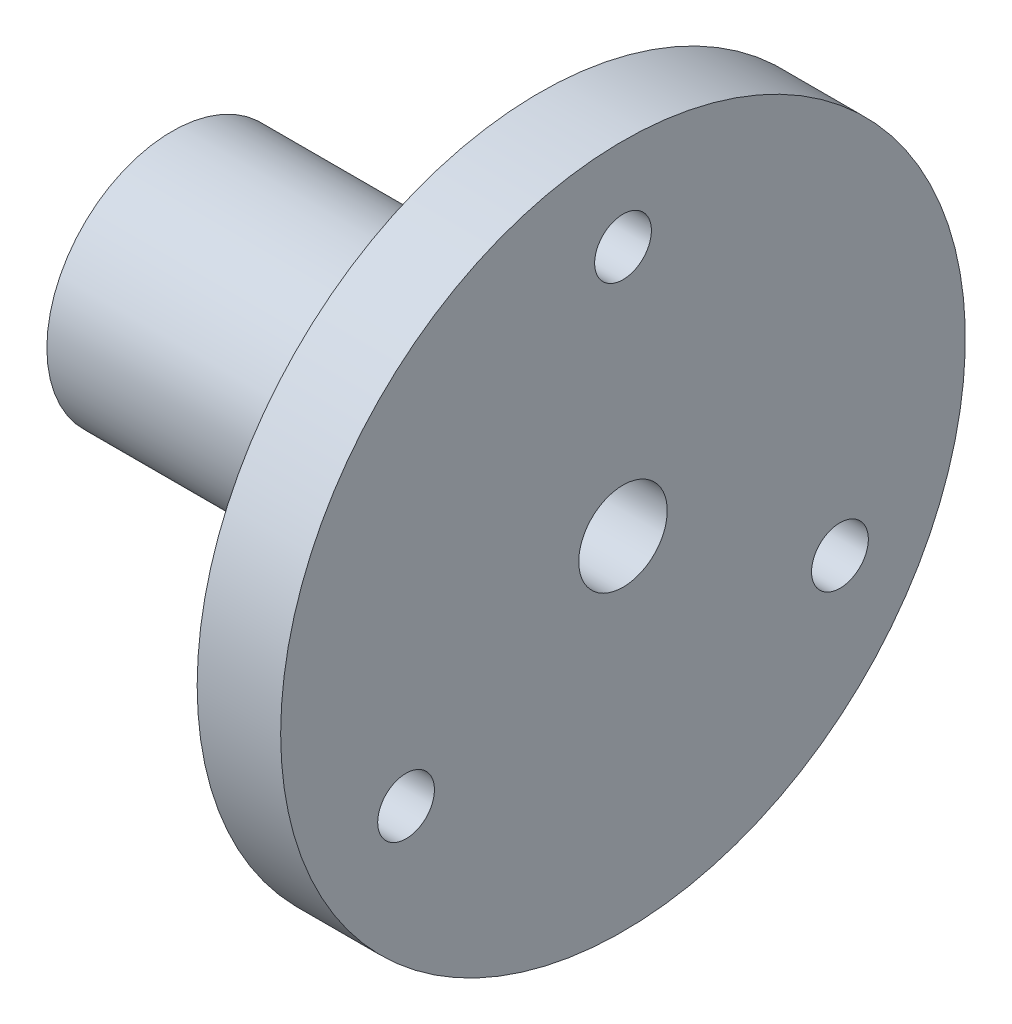
ISO-10303-21;
HEADER;
FILE_DESCRIPTION(('STEP AP214'),'2;1');
FILE_NAME('part.step','',(''),(''),'','','');
FILE_SCHEMA(('AUTOMOTIVE_DESIGN { 1 0 10303 214 1 1 1 1 }'));
ENDSEC;
DATA;
#1=APPLICATION_CONTEXT('core data for automotive mechanical design processes');
#2=APPLICATION_PROTOCOL_DEFINITION('international standard','automotive_design',2000,#1);
#3=PRODUCT_CONTEXT('',#1,'mechanical');
#4=PRODUCT('Part','Part','',(#3));
#5=PRODUCT_RELATED_PRODUCT_CATEGORY('part','',(#4));
#6=PRODUCT_DEFINITION_FORMATION('','',#4);
#7=PRODUCT_DEFINITION_CONTEXT('part definition',#1,'design');
#8=PRODUCT_DEFINITION('design','',#6,#7);
#9=PRODUCT_DEFINITION_SHAPE('','',#8);
#10=(LENGTH_UNIT() NAMED_UNIT(*) SI_UNIT(.MILLI.,.METRE.));
#11=(NAMED_UNIT(*) PLANE_ANGLE_UNIT() SI_UNIT($,.RADIAN.));
#12=(NAMED_UNIT(*) SI_UNIT($,.STERADIAN.) SOLID_ANGLE_UNIT());
#13=UNCERTAINTY_MEASURE_WITH_UNIT(LENGTH_MEASURE(1.E-05),#10,'distance_accuracy_value','');
#14=(GEOMETRIC_REPRESENTATION_CONTEXT(3) GLOBAL_UNCERTAINTY_ASSIGNED_CONTEXT((#13)) GLOBAL_UNIT_ASSIGNED_CONTEXT((#10,
#11,#12)) REPRESENTATION_CONTEXT('',''));
#15=CARTESIAN_POINT('',(0.,0.,0.));
#16=DIRECTION('',(0.,0.,1.));
#17=DIRECTION('',(1.,0.,0.));
#18=AXIS2_PLACEMENT_3D('',#15,#16,#17);
#19=CARTESIAN_POINT('',(133.802968881033,-120.764538930581,304.917842433595));
#20=DIRECTION('',(-1.,0.,0.));
#21=DIRECTION('',(0.,0.,1.));
#22=AXIS2_PLACEMENT_3D('',#19,#20,#21);
#23=PLANE('',#22);
#24=CARTESIAN_POINT('',(133.802968881033,-64.9584486046616,316.008976527623));
#25=DIRECTION('',(-1.,0.,0.));
#26=DIRECTION('',(0.,0.,1.));
#27=AXIS2_PLACEMENT_3D('',#24,#25,#26);
#28=CIRCLE('',#27,1.69999999999999);
#29=CARTESIAN_POINT('',(133.802968881033,-64.9584486046616,317.708976527623));
#30=VERTEX_POINT('',#29);
#31=EDGE_CURVE('E41',#30,#30,#28,.F.);
#32=ORIENTED_EDGE('',*,*,#31,.F.);
#33=EDGE_LOOP('',(#32));
#34=FACE_BOUND('',#33,.T.);
#35=CARTESIAN_POINT('',(133.802968881033,-87.4584486046616,303.018595470856));
#36=DIRECTION('',(-1.,0.,0.));
#37=DIRECTION('',(0.,0.,1.));
#38=AXIS2_PLACEMENT_3D('',#35,#36,#37);
#39=CIRCLE('',#38,1.69999999999999);
#40=CARTESIAN_POINT('',(133.802968881033,-87.4584486046616,304.718595470856));
#41=VERTEX_POINT('',#40);
#42=EDGE_CURVE('E48',#41,#41,#39,.F.);
#43=ORIENTED_EDGE('',*,*,#42,.F.);
#44=EDGE_LOOP('',(#43));
#45=FACE_BOUND('',#44,.T.);
#46=CARTESIAN_POINT('',(133.802968881033,-87.4584486046617,328.999357584389));
#47=DIRECTION('',(-1.,0.,0.));
#48=DIRECTION('',(0.,0.,1.));
#49=AXIS2_PLACEMENT_3D('',#46,#47,#48);
#50=CIRCLE('',#49,1.69999999999999);
#51=CARTESIAN_POINT('',(133.802968881033,-87.4584486046617,330.699357584389));
#52=VERTEX_POINT('',#51);
#53=EDGE_CURVE('E45',#52,#52,#50,.F.);
#54=ORIENTED_EDGE('',*,*,#53,.F.);
#55=EDGE_LOOP('',(#54));
#56=FACE_BOUND('',#55,.T.);
#57=CARTESIAN_POINT('',(133.802968881033,-79.9584486046616,316.008976527623));
#58=DIRECTION('',(-1.,0.,0.));
#59=DIRECTION('',(0.,0.,1.));
#60=AXIS2_PLACEMENT_3D('',#57,#58,#59);
#61=CIRCLE('',#60,20.5);
#62=CARTESIAN_POINT('',(133.802968881033,-79.9584486046616,336.508976527623));
#63=VERTEX_POINT('',#62);
#64=EDGE_CURVE('E10',#63,#63,#61,.F.);
#65=ORIENTED_EDGE('',*,*,#64,.T.);
#66=EDGE_LOOP('',(#65));
#67=FACE_BOUND('',#66,.T.);
#68=CARTESIAN_POINT('',(133.802968881033,-79.9584486046616,316.008976527623));
#69=DIRECTION('',(-1.,0.,0.));
#70=DIRECTION('',(0.,0.,1.));
#71=AXIS2_PLACEMENT_3D('',#68,#69,#70);
#72=CIRCLE('',#71,2.64999999999999);
#73=CARTESIAN_POINT('',(133.802968881033,-79.9584486046616,318.658976527623));
#74=VERTEX_POINT('',#73);
#75=EDGE_CURVE('E34',#74,#74,#72,.F.);
#76=ORIENTED_EDGE('',*,*,#75,.F.);
#77=EDGE_LOOP('',(#76));
#78=FACE_BOUND('',#77,.T.);
#79=ADVANCED_FACE('F31',(#34,#45,#56,#67,#78),#23,.F.);
#80=CARTESIAN_POINT('',(106.802968881033,-79.9584486046616,316.008976527623));
#81=DIRECTION('',(1.,0.,0.));
#82=DIRECTION('',(0.,0.,-1.));
#83=AXIS2_PLACEMENT_3D('',#80,#81,#82);
#84=CYLINDRICAL_SURFACE('',#83,7.50000000000001);
#85=CARTESIAN_POINT('',(106.802968881033,-79.9584486046616,316.008976527623));
#86=DIRECTION('',(-1.,0.,0.));
#87=DIRECTION('',(0.,0.,1.));
#88=AXIS2_PLACEMENT_3D('',#85,#86,#87);
#89=CIRCLE('',#88,7.50000000000001);
#90=CARTESIAN_POINT('',(106.802968881033,-79.9584486046616,323.508976527623));
#91=VERTEX_POINT('',#90);
#92=EDGE_CURVE('E51',#91,#91,#89,.T.);
#93=ORIENTED_EDGE('',*,*,#92,.F.);
#94=EDGE_LOOP('',(#93));
#95=FACE_BOUND('',#94,.T.);
#96=CARTESIAN_POINT('',(128.802968881033,-79.9584486046616,316.008976527623));
#97=DIRECTION('',(-1.,0.,0.));
#98=DIRECTION('',(0.,0.,1.));
#99=AXIS2_PLACEMENT_3D('',#96,#97,#98);
#100=CIRCLE('',#99,7.50000000000001);
#101=CARTESIAN_POINT('',(128.802968881033,-79.9584486046616,323.508976527623));
#102=VERTEX_POINT('',#101);
#103=EDGE_CURVE('E60',#102,#102,#100,.T.);
#104=ORIENTED_EDGE('',*,*,#103,.T.);
#105=EDGE_LOOP('',(#104));
#106=FACE_BOUND('',#105,.T.);
#107=ADVANCED_FACE('F88',(#95,#106),#84,.T.);
#108=CARTESIAN_POINT('',(128.802968881033,-79.9584486046616,316.008976527623));
#109=DIRECTION('',(1.,0.,0.));
#110=DIRECTION('',(0.,0.,-1.));
#111=AXIS2_PLACEMENT_3D('',#108,#109,#110);
#112=PLANE('',#111);
#113=CARTESIAN_POINT('',(128.802968881033,-87.4584486046616,303.018595470856));
#114=DIRECTION('',(-1.,0.,0.));
#115=DIRECTION('',(0.,0.,1.));
#116=AXIS2_PLACEMENT_3D('',#113,#114,#115);
#117=CIRCLE('',#116,3.15);
#118=CARTESIAN_POINT('',(128.802968881033,-87.4584486046616,306.168595470856));
#119=VERTEX_POINT('',#118);
#120=EDGE_CURVE('E78',#119,#119,#117,.T.);
#121=ORIENTED_EDGE('',*,*,#120,.F.);
#122=EDGE_LOOP('',(#121));
#123=FACE_BOUND('',#122,.T.);
#124=CARTESIAN_POINT('',(128.802968881033,-87.4584486046617,328.999357584389));
#125=DIRECTION('',(-1.,0.,0.));
#126=DIRECTION('',(0.,0.,1.));
#127=AXIS2_PLACEMENT_3D('',#124,#125,#126);
#128=CIRCLE('',#127,3.15);
#129=CARTESIAN_POINT('',(128.802968881033,-87.4584486046617,332.149357584389));
#130=VERTEX_POINT('',#129);
#131=EDGE_CURVE('E72',#130,#130,#128,.T.);
#132=ORIENTED_EDGE('',*,*,#131,.F.);
#133=EDGE_LOOP('',(#132));
#134=FACE_BOUND('',#133,.T.);
#135=CARTESIAN_POINT('',(128.802968881033,-64.9584486046616,316.008976527623));
#136=DIRECTION('',(-1.,0.,0.));
#137=DIRECTION('',(0.,0.,1.));
#138=AXIS2_PLACEMENT_3D('',#135,#136,#137);
#139=CIRCLE('',#138,3.15);
#140=CARTESIAN_POINT('',(128.802968881033,-64.9584486046616,319.158976527623));
#141=VERTEX_POINT('',#140);
#142=EDGE_CURVE('E66',#141,#141,#139,.T.);
#143=ORIENTED_EDGE('',*,*,#142,.F.);
#144=EDGE_LOOP('',(#143));
#145=FACE_BOUND('',#144,.T.);
#146=CARTESIAN_POINT('',(128.802968881033,-79.9584486046616,316.008976527623));
#147=DIRECTION('',(1.,0.,0.));
#148=DIRECTION('',(0.,0.,-1.));
#149=AXIS2_PLACEMENT_3D('',#146,#147,#148);
#150=CIRCLE('',#149,20.5);
#151=CARTESIAN_POINT('',(128.802968881033,-79.9584486046616,336.508976527623));
#152=VERTEX_POINT('',#151);
#153=EDGE_CURVE('E55',#152,#152,#150,.T.);
#154=ORIENTED_EDGE('',*,*,#153,.F.);
#155=EDGE_LOOP('',(#154));
#156=FACE_BOUND('',#155,.T.);
#157=ORIENTED_EDGE('',*,*,#103,.F.);
#158=EDGE_LOOP('',(#157));
#159=FACE_BOUND('',#158,.T.);
#160=ADVANCED_FACE('F84',(#123,#134,#145,#156,#159),#112,.F.);
#161=CARTESIAN_POINT('',(162.802968881033,-79.9584486046616,316.008976527623));
#162=DIRECTION('',(-1.,0.,0.));
#163=DIRECTION('',(0.,0.,1.));
#164=AXIS2_PLACEMENT_3D('',#161,#162,#163);
#165=CYLINDRICAL_SURFACE('',#164,20.5);
#166=CARTESIAN_POINT('',(133.802968881033,-79.9584486046616,336.508976527623));
#167=CARTESIAN_POINT('',(133.750885547699,-79.9584486046616,336.508976527623));
#168=CARTESIAN_POINT('',(133.698802214366,-79.9584486046616,336.508976527623));
#169=CARTESIAN_POINT('',(133.594635547699,-79.9584486046616,336.508976527623));
#170=CARTESIAN_POINT('',(133.542552214366,-79.9584486046616,336.508976527623));
#171=CARTESIAN_POINT('',(133.438385547699,-79.9584486046616,336.508976527623));
#172=CARTESIAN_POINT('',(133.386302214366,-79.9584486046616,336.508976527623));
#173=CARTESIAN_POINT('',(133.282135547699,-79.9584486046616,336.508976527623));
#174=CARTESIAN_POINT('',(133.230052214366,-79.9584486046616,336.508976527623));
#175=CARTESIAN_POINT('',(133.125885547699,-79.9584486046616,336.508976527623));
#176=CARTESIAN_POINT('',(133.073802214366,-79.9584486046616,336.508976527623));
#177=CARTESIAN_POINT('',(132.969635547699,-79.9584486046616,336.508976527623));
#178=CARTESIAN_POINT('',(132.917552214366,-79.9584486046616,336.508976527623));
#179=CARTESIAN_POINT('',(132.813385547699,-79.9584486046616,336.508976527623));
#180=CARTESIAN_POINT('',(132.761302214366,-79.9584486046616,336.508976527623));
#181=CARTESIAN_POINT('',(132.657135547699,-79.9584486046616,336.508976527623));
#182=CARTESIAN_POINT('',(132.605052214366,-79.9584486046616,336.508976527623));
#183=CARTESIAN_POINT('',(132.500885547699,-79.9584486046616,336.508976527623));
#184=CARTESIAN_POINT('',(132.448802214366,-79.9584486046616,336.508976527623));
#185=CARTESIAN_POINT('',(132.344635547699,-79.9584486046616,336.508976527623));
#186=CARTESIAN_POINT('',(132.292552214366,-79.9584486046616,336.508976527623));
#187=CARTESIAN_POINT('',(132.188385547699,-79.9584486046616,336.508976527623));
#188=CARTESIAN_POINT('',(132.136302214366,-79.9584486046616,336.508976527623));
#189=CARTESIAN_POINT('',(132.032135547699,-79.9584486046616,336.508976527623));
#190=CARTESIAN_POINT('',(131.980052214366,-79.9584486046616,336.508976527623));
#191=CARTESIAN_POINT('',(131.875885547699,-79.9584486046616,336.508976527623));
#192=CARTESIAN_POINT('',(131.823802214366,-79.9584486046616,336.508976527623));
#193=CARTESIAN_POINT('',(131.719635547699,-79.9584486046616,336.508976527623));
#194=CARTESIAN_POINT('',(131.667552214366,-79.9584486046616,336.508976527623));
#195=CARTESIAN_POINT('',(131.563385547699,-79.9584486046616,336.508976527623));
#196=CARTESIAN_POINT('',(131.511302214366,-79.9584486046616,336.508976527623));
#197=CARTESIAN_POINT('',(131.407135547699,-79.9584486046616,336.508976527623));
#198=CARTESIAN_POINT('',(131.355052214366,-79.9584486046616,336.508976527623));
#199=CARTESIAN_POINT('',(131.250885547699,-79.9584486046616,336.508976527623));
#200=CARTESIAN_POINT('',(131.198802214366,-79.9584486046616,336.508976527623));
#201=CARTESIAN_POINT('',(131.094635547699,-79.9584486046616,336.508976527623));
#202=CARTESIAN_POINT('',(131.042552214366,-79.9584486046616,336.508976527623));
#203=CARTESIAN_POINT('',(130.938385547699,-79.9584486046616,336.508976527623));
#204=CARTESIAN_POINT('',(130.886302214366,-79.9584486046616,336.508976527623));
#205=CARTESIAN_POINT('',(130.782135547699,-79.9584486046616,336.508976527623));
#206=CARTESIAN_POINT('',(130.730052214366,-79.9584486046616,336.508976527623));
#207=CARTESIAN_POINT('',(130.625885547699,-79.9584486046616,336.508976527623));
#208=CARTESIAN_POINT('',(130.573802214366,-79.9584486046616,336.508976527623));
#209=CARTESIAN_POINT('',(130.4696355477,-79.9584486046616,336.508976527623));
#210=CARTESIAN_POINT('',(130.417552214366,-79.9584486046616,336.508976527623));
#211=CARTESIAN_POINT('',(130.3133855477,-79.9584486046616,336.508976527623));
#212=CARTESIAN_POINT('',(130.261302214366,-79.9584486046616,336.508976527623));
#213=CARTESIAN_POINT('',(130.1571355477,-79.9584486046616,336.508976527623));
#214=CARTESIAN_POINT('',(130.105052214366,-79.9584486046616,336.508976527623));
#215=CARTESIAN_POINT('',(130.0008855477,-79.9584486046616,336.508976527623));
#216=CARTESIAN_POINT('',(129.948802214366,-79.9584486046616,336.508976527623));
#217=CARTESIAN_POINT('',(129.8446355477,-79.9584486046616,336.508976527623));
#218=CARTESIAN_POINT('',(129.792552214366,-79.9584486046616,336.508976527623));
#219=CARTESIAN_POINT('',(129.6883855477,-79.9584486046616,336.508976527623));
#220=CARTESIAN_POINT('',(129.636302214366,-79.9584486046616,336.508976527623));
#221=CARTESIAN_POINT('',(129.5321355477,-79.9584486046616,336.508976527623));
#222=CARTESIAN_POINT('',(129.480052214366,-79.9584486046616,336.508976527623));
#223=CARTESIAN_POINT('',(129.3758855477,-79.9584486046616,336.508976527623));
#224=CARTESIAN_POINT('',(129.323802214366,-79.9584486046616,336.508976527623));
#225=CARTESIAN_POINT('',(129.2196355477,-79.9584486046616,336.508976527623));
#226=CARTESIAN_POINT('',(129.167552214366,-79.9584486046616,336.508976527623));
#227=CARTESIAN_POINT('',(129.0633855477,-79.9584486046616,336.508976527623));
#228=CARTESIAN_POINT('',(129.011302214366,-79.9584486046616,336.508976527623));
#229=CARTESIAN_POINT('',(128.9071355477,-79.9584486046616,336.508976527623));
#230=CARTESIAN_POINT('',(128.855052214366,-79.9584486046616,336.508976527623));
#231=CARTESIAN_POINT('',(128.802968881033,-79.9584486046616,336.508976527623));
#232=B_SPLINE_CURVE_WITH_KNOTS('',3,(#166,#167,#168,#169,#170,#171,#172,#173,#174,#175,#176,
#177,#178,#179,#180,#181,#182,#183,#184,#185,#186,#187,#188,#189,#190,#191,#192,#193,#194,#195,
#196,#197,#198,#199,#200,#201,#202,#203,#204,#205,#206,#207,#208,#209,#210,#211,#212,#213,#214,
#215,#216,#217,#218,#219,#220,#221,#222,#223,#224,#225,#226,#227,#228,#229,#230,#231),
.UNSPECIFIED.,.F.,.F.,(4,2,2,2,2,2,2,2,2,2,2,2,2,2,2,2,2,2,2,2,2,2,2,2,2,2,2,2,2,2,2,2,4),(0.,
0.156249999999997,0.312499999999966,0.46874999999999,0.624999999999959,0.781249999999956,
0.937499999999952,1.09374999999995,1.24999999999995,1.40624999999994,1.56249999999994,
1.71874999999994,1.87499999999993,2.03124999999993,2.18749999999993,2.34374999999992,
2.49999999999992,2.65624999999992,2.81249999999991,2.96874999999991,3.12499999999991,
3.2812499999999,3.4374999999999,3.59374999999987,3.74999999999989,3.90624999999986,
4.06249999999989,4.21874999999985,4.37499999999988,4.53124999999985,4.68749999999984,
4.84374999999984,4.99999999999984),.UNSPECIFIED.);
#233=EDGE_CURVE('BSEAM87',#63,#152,#232,.T.);
#234=ORIENTED_EDGE('',*,*,#64,.F.);
#235=ORIENTED_EDGE('',*,*,#153,.T.);
#236=ORIENTED_EDGE('',*,*,#233,.T.);
#237=ORIENTED_EDGE('',*,*,#233,.F.);
#238=EDGE_LOOP('',(#234,#236,#235,#237));
#239=FACE_BOUND('',#238,.T.);
#240=ADVANCED_FACE('F87',(#239),#165,.T.);
#241=CARTESIAN_POINT('',(128.802968881033,-87.4584486046616,303.018595470856));
#242=DIRECTION('',(-1.,0.,0.));
#243=DIRECTION('',(0.,0.,1.));
#244=AXIS2_PLACEMENT_3D('',#241,#242,#243);
#245=CONICAL_SURFACE('',#244,3.15,0.785398163397448);
#246=CARTESIAN_POINT('',(130.252968881033,-87.4584486046616,303.018595470856));
#247=DIRECTION('',(-1.,0.,0.));
#248=DIRECTION('',(0.,0.,1.));
#249=AXIS2_PLACEMENT_3D('',#246,#247,#248);
#250=CIRCLE('',#249,1.69999999999999);
#251=CARTESIAN_POINT('',(130.252968881033,-87.4584486046616,304.718595470856));
#252=VERTEX_POINT('',#251);
#253=EDGE_CURVE('E75',#252,#252,#250,.T.);
#254=ORIENTED_EDGE('',*,*,#253,.F.);
#255=EDGE_LOOP('',(#254));
#256=FACE_BOUND('',#255,.T.);
#257=ORIENTED_EDGE('',*,*,#120,.T.);
#258=EDGE_LOOP('',(#257));
#259=FACE_BOUND('',#258,.T.);
#260=ADVANCED_FACE('F82',(#256,#259),#245,.F.);
#261=CARTESIAN_POINT('',(128.802968881033,-87.4584486046616,303.018595470856));
#262=DIRECTION('',(-1.,0.,0.));
#263=DIRECTION('',(0.,0.,1.));
#264=AXIS2_PLACEMENT_3D('',#261,#262,#263);
#265=CYLINDRICAL_SURFACE('',#264,1.69999999999999);
#266=ORIENTED_EDGE('',*,*,#42,.T.);
#267=EDGE_LOOP('',(#266));
#268=FACE_BOUND('',#267,.T.);
#269=ORIENTED_EDGE('',*,*,#253,.T.);
#270=EDGE_LOOP('',(#269));
#271=FACE_BOUND('',#270,.T.);
#272=ADVANCED_FACE('F132',(#268,#271),#265,.F.);
#273=CARTESIAN_POINT('',(128.802968881033,-87.4584486046617,328.999357584389));
#274=DIRECTION('',(-1.,0.,0.));
#275=DIRECTION('',(0.,0.,1.));
#276=AXIS2_PLACEMENT_3D('',#273,#274,#275);
#277=CONICAL_SURFACE('',#276,3.15,0.785398163397448);
#278=CARTESIAN_POINT('',(130.252968881033,-87.4584486046617,328.999357584389));
#279=DIRECTION('',(-1.,0.,0.));
#280=DIRECTION('',(0.,0.,1.));
#281=AXIS2_PLACEMENT_3D('',#278,#279,#280);
#282=CIRCLE('',#281,1.69999999999999);
#283=CARTESIAN_POINT('',(130.252968881033,-87.4584486046617,330.699357584389));
#284=VERTEX_POINT('',#283);
#285=EDGE_CURVE('E69',#284,#284,#282,.T.);
#286=ORIENTED_EDGE('',*,*,#285,.F.);
#287=EDGE_LOOP('',(#286));
#288=FACE_BOUND('',#287,.T.);
#289=ORIENTED_EDGE('',*,*,#131,.T.);
#290=EDGE_LOOP('',(#289));
#291=FACE_BOUND('',#290,.T.);
#292=ADVANCED_FACE('F128',(#288,#291),#277,.F.);
#293=CARTESIAN_POINT('',(128.802968881033,-87.4584486046617,328.999357584389));
#294=DIRECTION('',(-1.,0.,0.));
#295=DIRECTION('',(0.,0.,1.));
#296=AXIS2_PLACEMENT_3D('',#293,#294,#295);
#297=CYLINDRICAL_SURFACE('',#296,1.69999999999999);
#298=ORIENTED_EDGE('',*,*,#53,.T.);
#299=EDGE_LOOP('',(#298));
#300=FACE_BOUND('',#299,.T.);
#301=ORIENTED_EDGE('',*,*,#285,.T.);
#302=EDGE_LOOP('',(#301));
#303=FACE_BOUND('',#302,.T.);
#304=ADVANCED_FACE('F124',(#300,#303),#297,.F.);
#305=CARTESIAN_POINT('',(128.802968881033,-64.9584486046616,316.008976527623));
#306=DIRECTION('',(-1.,0.,0.));
#307=DIRECTION('',(0.,0.,1.));
#308=AXIS2_PLACEMENT_3D('',#305,#306,#307);
#309=CONICAL_SURFACE('',#308,3.15,0.785398163397448);
#310=CARTESIAN_POINT('',(130.252968881033,-64.9584486046616,316.008976527623));
#311=DIRECTION('',(-1.,0.,0.));
#312=DIRECTION('',(0.,0.,1.));
#313=AXIS2_PLACEMENT_3D('',#310,#311,#312);
#314=CIRCLE('',#313,1.69999999999999);
#315=CARTESIAN_POINT('',(130.252968881033,-64.9584486046616,317.708976527623));
#316=VERTEX_POINT('',#315);
#317=EDGE_CURVE('E63',#316,#316,#314,.T.);
#318=ORIENTED_EDGE('',*,*,#317,.F.);
#319=EDGE_LOOP('',(#318));
#320=FACE_BOUND('',#319,.T.);
#321=ORIENTED_EDGE('',*,*,#142,.T.);
#322=EDGE_LOOP('',(#321));
#323=FACE_BOUND('',#322,.T.);
#324=ADVANCED_FACE('F120',(#320,#323),#309,.F.);
#325=CARTESIAN_POINT('',(128.802968881033,-64.9584486046616,316.008976527623));
#326=DIRECTION('',(-1.,0.,0.));
#327=DIRECTION('',(0.,0.,1.));
#328=AXIS2_PLACEMENT_3D('',#325,#326,#327);
#329=CYLINDRICAL_SURFACE('',#328,1.69999999999999);
#330=ORIENTED_EDGE('',*,*,#31,.T.);
#331=EDGE_LOOP('',(#330));
#332=FACE_BOUND('',#331,.T.);
#333=ORIENTED_EDGE('',*,*,#317,.T.);
#334=EDGE_LOOP('',(#333));
#335=FACE_BOUND('',#334,.T.);
#336=ADVANCED_FACE('F110',(#332,#335),#329,.F.);
#337=CARTESIAN_POINT('',(106.802968881033,-79.9584486046616,316.008976527623));
#338=DIRECTION('',(-1.,0.,0.));
#339=DIRECTION('',(0.,0.,1.));
#340=AXIS2_PLACEMENT_3D('',#337,#338,#339);
#341=PLANE('',#340);
#342=CARTESIAN_POINT('',(106.802968881033,-79.9584486046616,316.008976527623));
#343=DIRECTION('',(-1.,0.,0.));
#344=DIRECTION('',(0.,0.,1.));
#345=AXIS2_PLACEMENT_3D('',#342,#343,#344);
#346=CIRCLE('',#345,2.64999999999999);
#347=CARTESIAN_POINT('',(106.802968881033,-79.9584486046616,318.658976527623));
#348=VERTEX_POINT('',#347);
#349=EDGE_CURVE('E52',#348,#348,#346,.T.);
#350=ORIENTED_EDGE('',*,*,#349,.F.);
#351=EDGE_LOOP('',(#350));
#352=FACE_BOUND('',#351,.T.);
#353=ORIENTED_EDGE('',*,*,#92,.T.);
#354=EDGE_LOOP('',(#353));
#355=FACE_BOUND('',#354,.T.);
#356=ADVANCED_FACE('F107',(#352,#355),#341,.T.);
#357=CARTESIAN_POINT('',(134.302968881033,-79.9584486046616,316.008976527623));
#358=DIRECTION('',(-1.,0.,0.));
#359=DIRECTION('',(0.,0.,1.));
#360=AXIS2_PLACEMENT_3D('',#357,#358,#359);
#361=CYLINDRICAL_SURFACE('',#360,2.64999999999999);
#362=ORIENTED_EDGE('',*,*,#75,.T.);
#363=EDGE_LOOP('',(#362));
#364=FACE_BOUND('',#363,.T.);
#365=ORIENTED_EDGE('',*,*,#349,.T.);
#366=EDGE_LOOP('',(#365));
#367=FACE_BOUND('',#366,.T.);
#368=ADVANCED_FACE('F104',(#364,#367),#361,.F.);
#369=CLOSED_SHELL('',(#79,#107,#160,#240,#260,#272,#292,#304,#324,#336,#356,#368));
#370=MANIFOLD_SOLID_BREP('B2',#369);
#371=ADVANCED_BREP_SHAPE_REPRESENTATION('',(#18,#370),#14);
#372=SHAPE_DEFINITION_REPRESENTATION(#9,#371);
ENDSEC;
END-ISO-10303-21;
